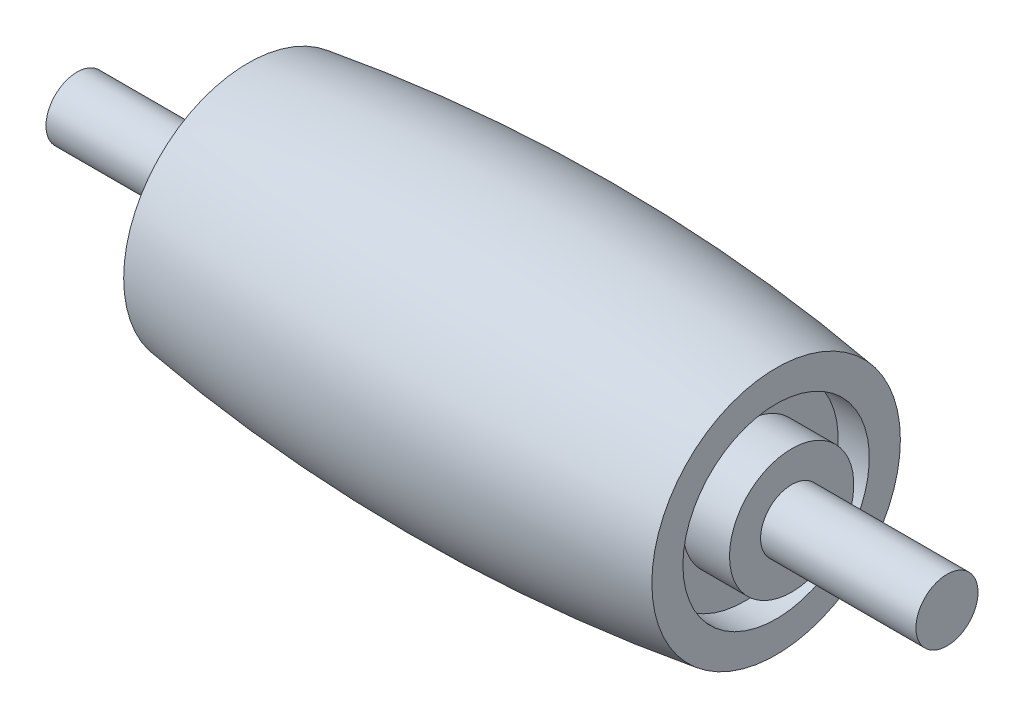
ISO-10303-21;
HEADER;
FILE_DESCRIPTION(('STEP AP214'),'2;1');
FILE_NAME('part.step','',(''),(''),'','','');
FILE_SCHEMA(('AUTOMOTIVE_DESIGN { 1 0 10303 214 1 1 1 1 }'));
ENDSEC;
DATA;
#1=APPLICATION_CONTEXT('core data for automotive mechanical design processes');
#2=APPLICATION_PROTOCOL_DEFINITION('international standard','automotive_design',2000,#1);
#3=PRODUCT_CONTEXT('',#1,'mechanical');
#4=PRODUCT('Part','Part','',(#3));
#5=PRODUCT_RELATED_PRODUCT_CATEGORY('part','',(#4));
#6=PRODUCT_DEFINITION_FORMATION('','',#4);
#7=PRODUCT_DEFINITION_CONTEXT('part definition',#1,'design');
#8=PRODUCT_DEFINITION('design','',#6,#7);
#9=PRODUCT_DEFINITION_SHAPE('','',#8);
#10=(LENGTH_UNIT() NAMED_UNIT(*) SI_UNIT(.MILLI.,.METRE.));
#11=(NAMED_UNIT(*) PLANE_ANGLE_UNIT() SI_UNIT($,.RADIAN.));
#12=(NAMED_UNIT(*) SI_UNIT($,.STERADIAN.) SOLID_ANGLE_UNIT());
#13=UNCERTAINTY_MEASURE_WITH_UNIT(LENGTH_MEASURE(1.E-05),#10,'distance_accuracy_value','');
#14=(GEOMETRIC_REPRESENTATION_CONTEXT(3) GLOBAL_UNCERTAINTY_ASSIGNED_CONTEXT((#13)) GLOBAL_UNIT_ASSIGNED_CONTEXT((#10,
#11,#12)) REPRESENTATION_CONTEXT('',''));
#15=CARTESIAN_POINT('',(0.,0.,0.));
#16=DIRECTION('',(0.,0.,1.));
#17=DIRECTION('',(1.,0.,0.));
#18=AXIS2_PLACEMENT_3D('',#15,#16,#17);
#19=CARTESIAN_POINT('',(7.51358218709086,0.,0.));
#20=DIRECTION('',(-1.,0.,0.));
#21=DIRECTION('',(0.,0.,1.));
#22=AXIS2_PLACEMENT_3D('',#19,#20,#21);
#23=PLANE('',#22);
#24=CARTESIAN_POINT('',(7.51358218709086,0.,0.));
#25=DIRECTION('',(-1.,0.,0.));
#26=DIRECTION('',(0.,0.,1.));
#27=AXIS2_PLACEMENT_3D('',#24,#25,#26);
#28=CIRCLE('',#27,3.);
#29=CARTESIAN_POINT('',(7.51358218709086,0.,3.));
#30=VERTEX_POINT('',#29);
#31=EDGE_CURVE('E70',#30,#30,#28,.T.);
#32=ORIENTED_EDGE('',*,*,#31,.F.);
#33=EDGE_LOOP('',(#32));
#34=FACE_BOUND('',#33,.T.);
#35=CARTESIAN_POINT('',(7.51358218709086,0.,0.));
#36=DIRECTION('',(-1.,0.,0.));
#37=DIRECTION('',(0.,0.,1.));
#38=AXIS2_PLACEMENT_3D('',#35,#36,#37);
#39=CIRCLE('',#38,4.);
#40=CARTESIAN_POINT('',(7.51358218709086,0.,4.));
#41=VERTEX_POINT('',#40);
#42=EDGE_CURVE('E51',#41,#41,#39,.T.);
#43=ORIENTED_EDGE('',*,*,#42,.T.);
#44=EDGE_LOOP('',(#43));
#45=FACE_BOUND('',#44,.T.);
#46=ADVANCED_FACE('F48',(#34,#45),#23,.T.);
#47=CARTESIAN_POINT('',(16.0135821870909,0.,0.));
#48=DIRECTION('',(-1.,0.,0.));
#49=DIRECTION('',(0.,0.,1.));
#50=AXIS2_PLACEMENT_3D('',#47,#48,#49);
#51=DEGENERATE_TOROIDAL_SURFACE('',#50,54.528194329205,59.1421975533306,.F.);
#52=CARTESIAN_POINT('',(24.5135821870908,0.,0.));
#53=DIRECTION('',(-1.,0.,0.));
#54=DIRECTION('',(0.,0.,1.));
#55=AXIS2_PLACEMENT_3D('',#52,#53,#54);
#56=CIRCLE('',#55,4.);
#57=CARTESIAN_POINT('',(24.5135821870908,0.,4.));
#58=VERTEX_POINT('',#57);
#59=EDGE_CURVE('E59',#58,#58,#56,.T.);
#60=ORIENTED_EDGE('',*,*,#59,.T.);
#61=EDGE_LOOP('',(#60));
#62=FACE_BOUND('',#61,.T.);
#63=ORIENTED_EDGE('',*,*,#42,.F.);
#64=EDGE_LOOP('',(#63));
#65=FACE_BOUND('',#64,.T.);
#66=ADVANCED_FACE('F78',(#62,#65),#51,.F.);
#67=CARTESIAN_POINT('',(24.5135821870908,0.,0.));
#68=DIRECTION('',(1.,0.,0.));
#69=DIRECTION('',(0.,0.,-1.));
#70=AXIS2_PLACEMENT_3D('',#67,#68,#69);
#71=PLANE('',#70);
#72=CARTESIAN_POINT('',(24.5135821870909,0.,0.));
#73=DIRECTION('',(-1.,0.,0.));
#74=DIRECTION('',(0.,0.,1.));
#75=AXIS2_PLACEMENT_3D('',#72,#73,#74);
#76=CIRCLE('',#75,3.);
#77=CARTESIAN_POINT('',(24.5135821870909,0.,3.));
#78=VERTEX_POINT('',#77);
#79=EDGE_CURVE('E281',#78,#78,#76,.T.);
#80=ORIENTED_EDGE('',*,*,#79,.T.);
#81=EDGE_LOOP('',(#80));
#82=FACE_BOUND('',#81,.T.);
#83=ORIENTED_EDGE('',*,*,#59,.F.);
#84=EDGE_LOOP('',(#83));
#85=FACE_BOUND('',#84,.T.);
#86=ADVANCED_FACE('F81',(#82,#85),#71,.T.);
#87=CARTESIAN_POINT('',(8.51358218709086,0.,0.));
#88=DIRECTION('',(-1.,0.,0.));
#89=DIRECTION('',(0.,0.,1.));
#90=AXIS2_PLACEMENT_3D('',#87,#88,#89);
#91=CYLINDRICAL_SURFACE('',#90,3.);
#92=CARTESIAN_POINT('',(8.51358218709086,0.,0.));
#93=DIRECTION('',(-1.,0.,0.));
#94=DIRECTION('',(0.,0.,1.));
#95=AXIS2_PLACEMENT_3D('',#92,#93,#94);
#96=CIRCLE('',#95,3.);
#97=CARTESIAN_POINT('',(8.51358218709086,0.,3.));
#98=VERTEX_POINT('',#97);
#99=EDGE_CURVE('E71',#98,#98,#96,.T.);
#100=ORIENTED_EDGE('',*,*,#99,.F.);
#101=EDGE_LOOP('',(#100));
#102=FACE_BOUND('',#101,.T.);
#103=ORIENTED_EDGE('',*,*,#31,.T.);
#104=EDGE_LOOP('',(#103));
#105=FACE_BOUND('',#104,.T.);
#106=ADVANCED_FACE('F83',(#102,#105),#91,.F.);
#107=CARTESIAN_POINT('',(8.51358218709086,0.,0.));
#108=DIRECTION('',(-1.,0.,0.));
#109=DIRECTION('',(0.,0.,1.));
#110=AXIS2_PLACEMENT_3D('',#107,#108,#109);
#111=PLANE('',#110);
#112=CARTESIAN_POINT('',(8.51358218709086,0.,0.));
#113=DIRECTION('',(-1.,0.,0.));
#114=DIRECTION('',(0.,0.,1.));
#115=AXIS2_PLACEMENT_3D('',#112,#113,#114);
#116=CIRCLE('',#115,2.);
#117=CARTESIAN_POINT('',(8.51358218709086,0.,2.));
#118=VERTEX_POINT('',#117);
#119=EDGE_CURVE('E67',#118,#118,#116,.T.);
#120=ORIENTED_EDGE('',*,*,#119,.F.);
#121=EDGE_LOOP('',(#120));
#122=FACE_BOUND('',#121,.T.);
#123=ORIENTED_EDGE('',*,*,#99,.T.);
#124=EDGE_LOOP('',(#123));
#125=FACE_BOUND('',#124,.T.);
#126=ADVANCED_FACE('F90',(#122,#125),#111,.T.);
#127=CARTESIAN_POINT('',(8.51358218709086,0.,0.));
#128=DIRECTION('',(-1.,0.,0.));
#129=DIRECTION('',(0.,0.,1.));
#130=AXIS2_PLACEMENT_3D('',#127,#128,#129);
#131=CYLINDRICAL_SURFACE('',#130,2.);
#132=ORIENTED_EDGE('',*,*,#119,.T.);
#133=EDGE_LOOP('',(#132));
#134=FACE_BOUND('',#133,.T.);
#135=CARTESIAN_POINT('',(7.01358218709086,0.,0.));
#136=DIRECTION('',(-1.,0.,0.));
#137=DIRECTION('',(0.,0.,1.));
#138=AXIS2_PLACEMENT_3D('',#135,#136,#137);
#139=CIRCLE('',#138,2.);
#140=CARTESIAN_POINT('',(7.01358218709086,0.,2.));
#141=VERTEX_POINT('',#140);
#142=EDGE_CURVE('E64',#141,#141,#139,.T.);
#143=ORIENTED_EDGE('',*,*,#142,.F.);
#144=EDGE_LOOP('',(#143));
#145=FACE_BOUND('',#144,.T.);
#146=ADVANCED_FACE('F127',(#134,#145),#131,.T.);
#147=CARTESIAN_POINT('',(7.01358218709086,0.,0.));
#148=DIRECTION('',(-1.,0.,0.));
#149=DIRECTION('',(0.,0.,1.));
#150=AXIS2_PLACEMENT_3D('',#147,#148,#149);
#151=PLANE('',#150);
#152=CARTESIAN_POINT('',(7.01358218709086,0.,0.));
#153=DIRECTION('',(-1.,0.,0.));
#154=DIRECTION('',(0.,0.,1.));
#155=AXIS2_PLACEMENT_3D('',#152,#153,#154);
#156=CIRCLE('',#155,1.);
#157=CARTESIAN_POINT('',(7.01358218709086,0.,1.));
#158=VERTEX_POINT('',#157);
#159=EDGE_CURVE('E11',#158,#158,#156,.T.);
#160=ORIENTED_EDGE('',*,*,#159,.F.);
#161=EDGE_LOOP('',(#160));
#162=FACE_BOUND('',#161,.T.);
#163=ORIENTED_EDGE('',*,*,#142,.T.);
#164=EDGE_LOOP('',(#163));
#165=FACE_BOUND('',#164,.T.);
#166=ADVANCED_FACE('F138',(#162,#165),#151,.T.);
#167=CARTESIAN_POINT('',(2.01358218709086,0.,0.));
#168=DIRECTION('',(1.,0.,0.));
#169=DIRECTION('',(0.,0.,-1.));
#170=AXIS2_PLACEMENT_3D('',#167,#168,#169);
#171=CYLINDRICAL_SURFACE('',#170,1.);
#172=CARTESIAN_POINT('',(2.01358218709086,0.,0.));
#173=DIRECTION('',(-1.,0.,0.));
#174=DIRECTION('',(0.,0.,1.));
#175=AXIS2_PLACEMENT_3D('',#172,#173,#174);
#176=CIRCLE('',#175,1.);
#177=CARTESIAN_POINT('',(2.01358218709086,0.,1.));
#178=VERTEX_POINT('',#177);
#179=EDGE_CURVE('E62',#178,#178,#176,.T.);
#180=ORIENTED_EDGE('',*,*,#179,.F.);
#181=EDGE_LOOP('',(#180));
#182=FACE_BOUND('',#181,.T.);
#183=ORIENTED_EDGE('',*,*,#159,.T.);
#184=EDGE_LOOP('',(#183));
#185=FACE_BOUND('',#184,.T.);
#186=ADVANCED_FACE('F149',(#182,#185),#171,.T.);
#187=CARTESIAN_POINT('',(2.01358218709086,0.,0.));
#188=DIRECTION('',(-1.,0.,0.));
#189=DIRECTION('',(0.,0.,1.));
#190=AXIS2_PLACEMENT_3D('',#187,#188,#189);
#191=PLANE('',#190);
#192=ORIENTED_EDGE('',*,*,#179,.T.);
#193=EDGE_LOOP('',(#192));
#194=FACE_BOUND('',#193,.T.);
#195=ADVANCED_FACE('F158',(#194),#191,.T.);
#196=CARTESIAN_POINT('',(23.5135821870909,0.,0.));
#197=DIRECTION('',(1.,0.,0.));
#198=DIRECTION('',(0.,0.,1.));
#199=AXIS2_PLACEMENT_3D('',#196,#197,#198);
#200=PLANE('',#199);
#201=CARTESIAN_POINT('',(23.5135821870909,0.,0.));
#202=DIRECTION('',(-1.,0.,0.));
#203=DIRECTION('',(0.,0.,1.));
#204=AXIS2_PLACEMENT_3D('',#201,#202,#203);
#205=CIRCLE('',#204,3.);
#206=CARTESIAN_POINT('',(23.5135821870909,0.,3.));
#207=VERTEX_POINT('',#206);
#208=EDGE_CURVE('E282',#207,#207,#205,.T.);
#209=ORIENTED_EDGE('',*,*,#208,.F.);
#210=EDGE_LOOP('',(#209));
#211=FACE_BOUND('',#210,.T.);
#212=CARTESIAN_POINT('',(23.5135821870909,0.,0.));
#213=DIRECTION('',(-1.,0.,0.));
#214=DIRECTION('',(0.,0.,1.));
#215=AXIS2_PLACEMENT_3D('',#212,#213,#214);
#216=CIRCLE('',#215,2.);
#217=CARTESIAN_POINT('',(23.5135821870909,0.,2.));
#218=VERTEX_POINT('',#217);
#219=EDGE_CURVE('E274',#218,#218,#216,.T.);
#220=ORIENTED_EDGE('',*,*,#219,.T.);
#221=EDGE_LOOP('',(#220));
#222=FACE_BOUND('',#221,.T.);
#223=ADVANCED_FACE('F168',(#211,#222),#200,.T.);
#224=CARTESIAN_POINT('',(23.5135821870909,0.,0.));
#225=DIRECTION('',(1.,0.,0.));
#226=DIRECTION('',(0.,0.,-1.));
#227=AXIS2_PLACEMENT_3D('',#224,#225,#226);
#228=CYLINDRICAL_SURFACE('',#227,3.);
#229=ORIENTED_EDGE('',*,*,#208,.T.);
#230=EDGE_LOOP('',(#229));
#231=FACE_BOUND('',#230,.T.);
#232=ORIENTED_EDGE('',*,*,#79,.F.);
#233=EDGE_LOOP('',(#232));
#234=FACE_BOUND('',#233,.T.);
#235=ADVANCED_FACE('F179',(#231,#234),#228,.F.);
#236=CARTESIAN_POINT('',(23.5135821870909,0.,0.));
#237=DIRECTION('',(1.,0.,0.));
#238=DIRECTION('',(0.,0.,-1.));
#239=AXIS2_PLACEMENT_3D('',#236,#237,#238);
#240=CYLINDRICAL_SURFACE('',#239,2.);
#241=ORIENTED_EDGE('',*,*,#219,.F.);
#242=EDGE_LOOP('',(#241));
#243=FACE_BOUND('',#242,.T.);
#244=CARTESIAN_POINT('',(25.0135821870909,0.,0.));
#245=DIRECTION('',(-1.,0.,0.));
#246=DIRECTION('',(0.,0.,1.));
#247=AXIS2_PLACEMENT_3D('',#244,#245,#246);
#248=CIRCLE('',#247,2.);
#249=CARTESIAN_POINT('',(25.0135821870909,0.,2.));
#250=VERTEX_POINT('',#249);
#251=EDGE_CURVE('E270',#250,#250,#248,.T.);
#252=ORIENTED_EDGE('',*,*,#251,.T.);
#253=EDGE_LOOP('',(#252));
#254=FACE_BOUND('',#253,.T.);
#255=ADVANCED_FACE('F189',(#243,#254),#240,.T.);
#256=CARTESIAN_POINT('',(25.0135821870909,0.,0.));
#257=DIRECTION('',(1.,0.,0.));
#258=DIRECTION('',(0.,0.,1.));
#259=AXIS2_PLACEMENT_3D('',#256,#257,#258);
#260=PLANE('',#259);
#261=CARTESIAN_POINT('',(25.0135821870909,0.,0.));
#262=DIRECTION('',(-1.,0.,0.));
#263=DIRECTION('',(0.,0.,1.));
#264=AXIS2_PLACEMENT_3D('',#261,#262,#263);
#265=CIRCLE('',#264,1.);
#266=CARTESIAN_POINT('',(25.0135821870909,0.,1.));
#267=VERTEX_POINT('',#266);
#268=EDGE_CURVE('E271',#267,#267,#265,.T.);
#269=ORIENTED_EDGE('',*,*,#268,.T.);
#270=EDGE_LOOP('',(#269));
#271=FACE_BOUND('',#270,.T.);
#272=ORIENTED_EDGE('',*,*,#251,.F.);
#273=EDGE_LOOP('',(#272));
#274=FACE_BOUND('',#273,.T.);
#275=ADVANCED_FACE('F198',(#271,#274),#260,.T.);
#276=CARTESIAN_POINT('',(30.0135821870909,0.,0.));
#277=DIRECTION('',(-1.,0.,0.));
#278=DIRECTION('',(0.,0.,1.));
#279=AXIS2_PLACEMENT_3D('',#276,#277,#278);
#280=CYLINDRICAL_SURFACE('',#279,1.);
#281=CARTESIAN_POINT('',(30.0135821870909,0.,0.));
#282=DIRECTION('',(-1.,0.,0.));
#283=DIRECTION('',(0.,0.,1.));
#284=AXIS2_PLACEMENT_3D('',#281,#282,#283);
#285=CIRCLE('',#284,1.);
#286=CARTESIAN_POINT('',(30.0135821870909,0.,1.));
#287=VERTEX_POINT('',#286);
#288=EDGE_CURVE('E269',#287,#287,#285,.T.);
#289=ORIENTED_EDGE('',*,*,#288,.T.);
#290=EDGE_LOOP('',(#289));
#291=FACE_BOUND('',#290,.T.);
#292=ORIENTED_EDGE('',*,*,#268,.F.);
#293=EDGE_LOOP('',(#292));
#294=FACE_BOUND('',#293,.T.);
#295=ADVANCED_FACE('F207',(#291,#294),#280,.T.);
#296=CARTESIAN_POINT('',(30.0135821870909,0.,0.));
#297=DIRECTION('',(1.,0.,0.));
#298=DIRECTION('',(0.,0.,1.));
#299=AXIS2_PLACEMENT_3D('',#296,#297,#298);
#300=PLANE('',#299);
#301=ORIENTED_EDGE('',*,*,#288,.F.);
#302=EDGE_LOOP('',(#301));
#303=FACE_BOUND('',#302,.T.);
#304=ADVANCED_FACE('F216',(#303),#300,.T.);
#305=CLOSED_SHELL('',(#46,#66,#86,#106,#126,#146,#166,#186,#195,#223,#235,#255,#275,#295,#304));
#306=MANIFOLD_SOLID_BREP('B2',#305);
#307=ADVANCED_BREP_SHAPE_REPRESENTATION('',(#18,#306),#14);
#308=SHAPE_DEFINITION_REPRESENTATION(#9,#307);
ENDSEC;
END-ISO-10303-21;
